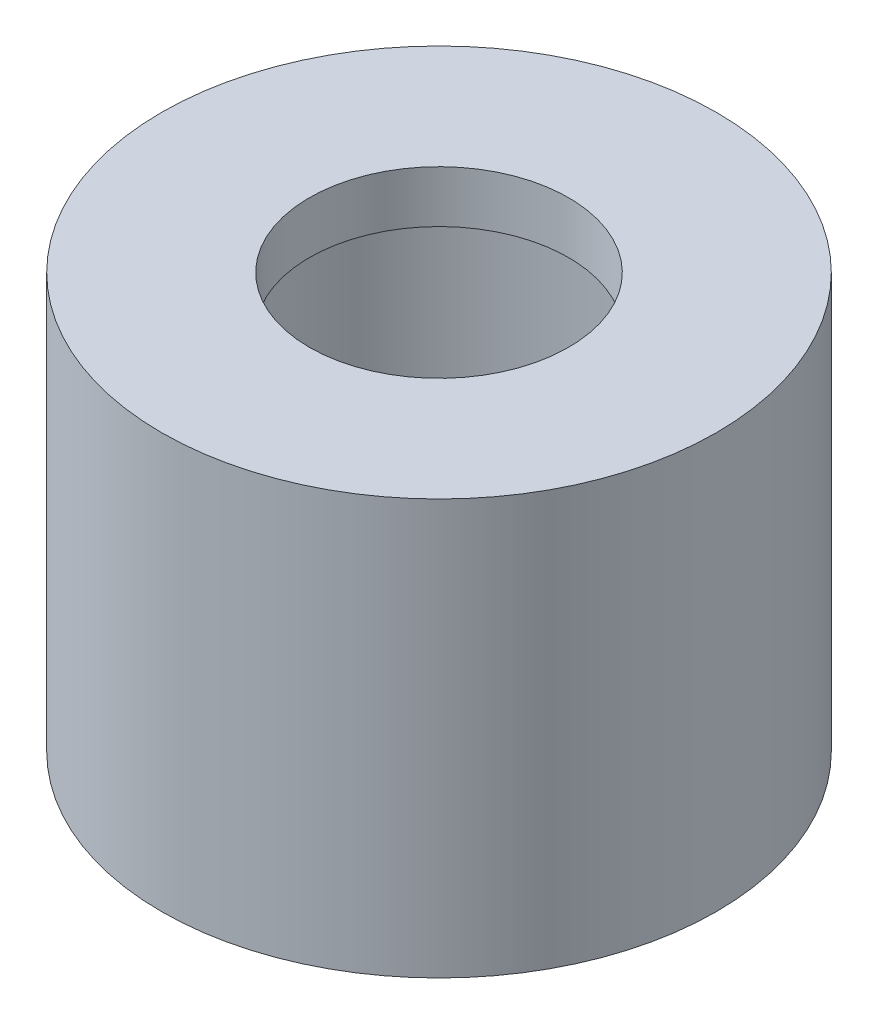
ISO-10303-21;
HEADER;
FILE_DESCRIPTION(('STEP AP214'),'2;1');
FILE_NAME('part.step','',(''),(''),'','','');
FILE_SCHEMA(('AUTOMOTIVE_DESIGN { 1 0 10303 214 1 1 1 1 }'));
ENDSEC;
DATA;
#1=APPLICATION_CONTEXT('core data for automotive mechanical design processes');
#2=APPLICATION_PROTOCOL_DEFINITION('international standard','automotive_design',2000,#1);
#3=PRODUCT_CONTEXT('',#1,'mechanical');
#4=PRODUCT('Part','Part','',(#3));
#5=PRODUCT_RELATED_PRODUCT_CATEGORY('part','',(#4));
#6=PRODUCT_DEFINITION_FORMATION('','',#4);
#7=PRODUCT_DEFINITION_CONTEXT('part definition',#1,'design');
#8=PRODUCT_DEFINITION('design','',#6,#7);
#9=PRODUCT_DEFINITION_SHAPE('','',#8);
#10=(LENGTH_UNIT() NAMED_UNIT(*) SI_UNIT(.MILLI.,.METRE.));
#11=(NAMED_UNIT(*) PLANE_ANGLE_UNIT() SI_UNIT($,.RADIAN.));
#12=(NAMED_UNIT(*) SI_UNIT($,.STERADIAN.) SOLID_ANGLE_UNIT());
#13=UNCERTAINTY_MEASURE_WITH_UNIT(LENGTH_MEASURE(1.E-05),#10,'distance_accuracy_value','');
#14=(GEOMETRIC_REPRESENTATION_CONTEXT(3) GLOBAL_UNCERTAINTY_ASSIGNED_CONTEXT((#13)) GLOBAL_UNIT_ASSIGNED_CONTEXT((#10,
#11,#12)) REPRESENTATION_CONTEXT('',''));
#15=CARTESIAN_POINT('',(0.,0.,0.));
#16=DIRECTION('',(0.,0.,1.));
#17=DIRECTION('',(1.,0.,0.));
#18=AXIS2_PLACEMENT_3D('',#15,#16,#17);
#19=CARTESIAN_POINT('',(0.,3.,0.));
#20=DIRECTION('',(0.,-1.,0.));
#21=DIRECTION('',(0.,0.,-1.));
#22=AXIS2_PLACEMENT_3D('',#19,#20,#21);
#23=CYLINDRICAL_SURFACE('',#22,4.);
#24=CARTESIAN_POINT('',(0.,-5.,0.));
#25=DIRECTION('',(0.,-1.,0.));
#26=DIRECTION('',(0.,0.,-1.));
#27=AXIS2_PLACEMENT_3D('',#24,#25,#26);
#28=CIRCLE('',#27,4.);
#29=CARTESIAN_POINT('',(0.,-5.,-4.));
#30=VERTEX_POINT('',#29);
#31=EDGE_CURVE('E44',#30,#30,#28,.T.);
#32=ORIENTED_EDGE('',*,*,#31,.T.);
#33=EDGE_LOOP('',(#32));
#34=FACE_BOUND('',#33,.T.);
#35=CARTESIAN_POINT('',(0.,2.,0.));
#36=DIRECTION('',(0.,1.,0.));
#37=DIRECTION('',(0.,0.,1.));
#38=AXIS2_PLACEMENT_3D('',#35,#36,#37);
#39=CIRCLE('',#38,4.);
#40=CARTESIAN_POINT('',(0.,2.,4.));
#41=VERTEX_POINT('',#40);
#42=EDGE_CURVE('E48',#41,#41,#39,.T.);
#43=ORIENTED_EDGE('',*,*,#42,.T.);
#44=EDGE_LOOP('',(#43));
#45=FACE_BOUND('',#44,.T.);
#46=ADVANCED_FACE('F33',(#34,#45),#23,.F.);
#47=CARTESIAN_POINT('',(0.,3.,0.));
#48=DIRECTION('',(0.,1.,0.));
#49=DIRECTION('',(0.,0.,1.));
#50=AXIS2_PLACEMENT_3D('',#47,#48,#49);
#51=PLANE('',#50);
#52=CARTESIAN_POINT('',(0.,3.,0.));
#53=DIRECTION('',(0.,1.,0.));
#54=DIRECTION('',(0.,0.,1.));
#55=AXIS2_PLACEMENT_3D('',#52,#53,#54);
#56=CIRCLE('',#55,2.5);
#57=CARTESIAN_POINT('',(0.,3.,2.5));
#58=VERTEX_POINT('',#57);
#59=EDGE_CURVE('E54',#58,#58,#56,.T.);
#60=ORIENTED_EDGE('',*,*,#59,.F.);
#61=EDGE_LOOP('',(#60));
#62=FACE_BOUND('',#61,.T.);
#63=CARTESIAN_POINT('',(0.,3.,0.));
#64=DIRECTION('',(0.,1.,0.));
#65=DIRECTION('',(0.,0.,1.));
#66=AXIS2_PLACEMENT_3D('',#63,#64,#65);
#67=CIRCLE('',#66,5.35);
#68=CARTESIAN_POINT('',(0.,3.,5.35));
#69=VERTEX_POINT('',#68);
#70=EDGE_CURVE('E10',#69,#69,#67,.T.);
#71=ORIENTED_EDGE('',*,*,#70,.T.);
#72=EDGE_LOOP('',(#71));
#73=FACE_BOUND('',#72,.T.);
#74=ADVANCED_FACE('F69',(#62,#73),#51,.T.);
#75=CARTESIAN_POINT('',(0.,3.,0.));
#76=DIRECTION('',(0.,-1.,0.));
#77=DIRECTION('',(0.,0.,-1.));
#78=AXIS2_PLACEMENT_3D('',#75,#76,#77);
#79=CYLINDRICAL_SURFACE('',#78,5.35);
#80=ORIENTED_EDGE('',*,*,#70,.F.);
#81=EDGE_LOOP('',(#80));
#82=FACE_BOUND('',#81,.T.);
#83=CARTESIAN_POINT('',(0.,-5.,0.));
#84=DIRECTION('',(0.,-1.,0.));
#85=DIRECTION('',(0.,0.,-1.));
#86=AXIS2_PLACEMENT_3D('',#83,#84,#85);
#87=CIRCLE('',#86,5.35);
#88=CARTESIAN_POINT('',(0.,-5.,-5.35));
#89=VERTEX_POINT('',#88);
#90=EDGE_CURVE('E40',#89,#89,#87,.T.);
#91=ORIENTED_EDGE('',*,*,#90,.F.);
#92=EDGE_LOOP('',(#91));
#93=FACE_BOUND('',#92,.T.);
#94=ADVANCED_FACE('F35',(#82,#93),#79,.T.);
#95=CARTESIAN_POINT('',(0.,-5.,0.));
#96=DIRECTION('',(0.,-1.,0.));
#97=DIRECTION('',(0.,0.,-1.));
#98=AXIS2_PLACEMENT_3D('',#95,#96,#97);
#99=PLANE('',#98);
#100=ORIENTED_EDGE('',*,*,#90,.T.);
#101=EDGE_LOOP('',(#100));
#102=FACE_BOUND('',#101,.T.);
#103=ORIENTED_EDGE('',*,*,#31,.F.);
#104=EDGE_LOOP('',(#103));
#105=FACE_BOUND('',#104,.T.);
#106=ADVANCED_FACE('F75',(#102,#105),#99,.T.);
#107=CARTESIAN_POINT('',(0.,2.,0.));
#108=DIRECTION('',(0.,1.,0.));
#109=DIRECTION('',(0.,0.,1.));
#110=AXIS2_PLACEMENT_3D('',#107,#108,#109);
#111=PLANE('',#110);
#112=CARTESIAN_POINT('',(0.,2.,0.));
#113=DIRECTION('',(0.,1.,0.));
#114=DIRECTION('',(0.,0.,1.));
#115=AXIS2_PLACEMENT_3D('',#112,#113,#114);
#116=CIRCLE('',#115,2.5);
#117=CARTESIAN_POINT('',(0.,2.,2.5));
#118=VERTEX_POINT('',#117);
#119=EDGE_CURVE('E53',#118,#118,#116,.T.);
#120=ORIENTED_EDGE('',*,*,#119,.T.);
#121=EDGE_LOOP('',(#120));
#122=FACE_BOUND('',#121,.T.);
#123=ORIENTED_EDGE('',*,*,#42,.F.);
#124=EDGE_LOOP('',(#123));
#125=FACE_BOUND('',#124,.T.);
#126=ADVANCED_FACE('F60',(#122,#125),#111,.F.);
#127=CARTESIAN_POINT('',(0.,2.,0.));
#128=DIRECTION('',(0.,1.,0.));
#129=DIRECTION('',(0.,0.,1.));
#130=AXIS2_PLACEMENT_3D('',#127,#128,#129);
#131=CYLINDRICAL_SURFACE('',#130,2.5);
#132=ORIENTED_EDGE('',*,*,#119,.F.);
#133=EDGE_LOOP('',(#132));
#134=FACE_BOUND('',#133,.T.);
#135=ORIENTED_EDGE('',*,*,#59,.T.);
#136=EDGE_LOOP('',(#135));
#137=FACE_BOUND('',#136,.T.);
#138=ADVANCED_FACE('F63',(#134,#137),#131,.F.);
#139=CLOSED_SHELL('',(#46,#74,#94,#106,#126,#138));
#140=MANIFOLD_SOLID_BREP('B2',#139);
#141=ADVANCED_BREP_SHAPE_REPRESENTATION('',(#18,#140),#14);
#142=SHAPE_DEFINITION_REPRESENTATION(#9,#141);
ENDSEC;
END-ISO-10303-21;
